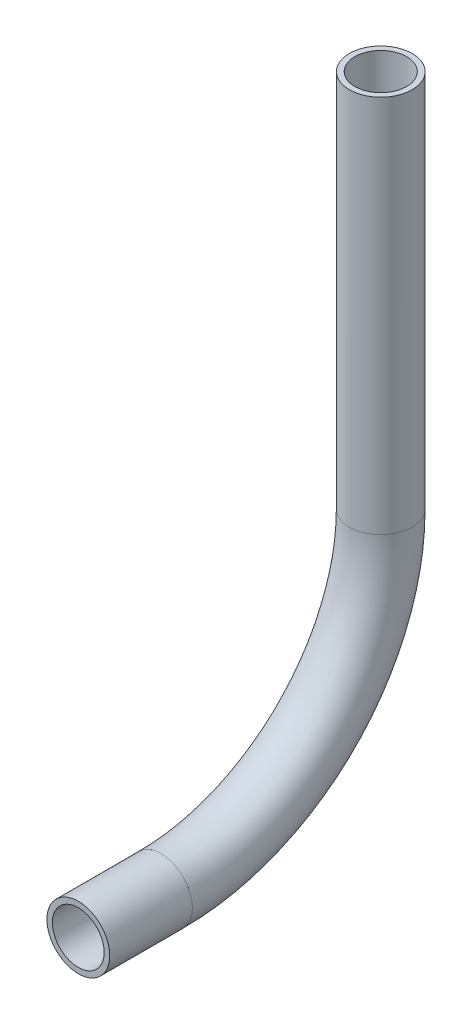
ISO-10303-21;
HEADER;
FILE_DESCRIPTION(('STEP AP214'),'2;1');
FILE_NAME('part.step','',(''),(''),'','','');
FILE_SCHEMA(('AUTOMOTIVE_DESIGN { 1 0 10303 214 1 1 1 1 }'));
ENDSEC;
DATA;
#1=APPLICATION_CONTEXT('core data for automotive mechanical design processes');
#2=APPLICATION_PROTOCOL_DEFINITION('international standard','automotive_design',2000,#1);
#3=PRODUCT_CONTEXT('',#1,'mechanical');
#4=PRODUCT('Part','Part','',(#3));
#5=PRODUCT_RELATED_PRODUCT_CATEGORY('part','',(#4));
#6=PRODUCT_DEFINITION_FORMATION('','',#4);
#7=PRODUCT_DEFINITION_CONTEXT('part definition',#1,'design');
#8=PRODUCT_DEFINITION('design','',#6,#7);
#9=PRODUCT_DEFINITION_SHAPE('','',#8);
#10=(LENGTH_UNIT() NAMED_UNIT(*) SI_UNIT(.MILLI.,.METRE.));
#11=(NAMED_UNIT(*) PLANE_ANGLE_UNIT() SI_UNIT($,.RADIAN.));
#12=(NAMED_UNIT(*) SI_UNIT($,.STERADIAN.) SOLID_ANGLE_UNIT());
#13=UNCERTAINTY_MEASURE_WITH_UNIT(LENGTH_MEASURE(1.E-05),#10,'distance_accuracy_value','');
#14=(GEOMETRIC_REPRESENTATION_CONTEXT(3) GLOBAL_UNCERTAINTY_ASSIGNED_CONTEXT((#13)) GLOBAL_UNIT_ASSIGNED_CONTEXT((#10,
#11,#12)) REPRESENTATION_CONTEXT('',''));
#15=CARTESIAN_POINT('',(0.,0.,0.));
#16=DIRECTION('',(0.,0.,1.));
#17=DIRECTION('',(1.,0.,0.));
#18=AXIS2_PLACEMENT_3D('',#15,#16,#17);
#19=CARTESIAN_POINT('',(0.,600.03453506682,294.786169017656));
#20=DIRECTION('',(0.,0.,1.));
#21=DIRECTION('',(1.,0.,0.));
#22=AXIS2_PLACEMENT_3D('',#19,#20,#21);
#23=CYLINDRICAL_SURFACE('',#22,2.61620000000002);
#24=CARTESIAN_POINT('',(0.,600.03453506682,303.14462575866));
#25=DIRECTION('',(0.,0.,-1.));
#26=DIRECTION('',(-1.,0.,0.));
#27=AXIS2_PLACEMENT_3D('',#24,#25,#26);
#28=CIRCLE('',#27,2.61620000000002);
#29=CARTESIAN_POINT('',(-2.61620000000002,600.03453506682,303.14462575866));
#30=VERTEX_POINT('',#29);
#31=EDGE_CURVE('E55',#30,#30,#28,.T.);
#32=ORIENTED_EDGE('',*,*,#31,.F.);
#33=EDGE_LOOP('',(#32));
#34=FACE_BOUND('',#33,.T.);
#35=CARTESIAN_POINT('',(0.,600.03453506682,294.786169017656));
#36=DIRECTION('',(0.,0.,-1.));
#37=DIRECTION('',(-1.,0.,0.));
#38=AXIS2_PLACEMENT_3D('',#35,#36,#37);
#39=CIRCLE('',#38,2.61620000000002);
#40=CARTESIAN_POINT('',(-2.61620000000002,600.03453506682,294.786169017656));
#41=VERTEX_POINT('',#40);
#42=EDGE_CURVE('E51',#41,#41,#39,.T.);
#43=ORIENTED_EDGE('',*,*,#42,.T.);
#44=EDGE_LOOP('',(#43));
#45=FACE_BOUND('',#44,.T.);
#46=ADVANCED_FACE('F47',(#34,#45),#23,.F.);
#47=CARTESIAN_POINT('',(0.,600.03453506682,294.786169017656));
#48=DIRECTION('',(0.,0.,1.));
#49=DIRECTION('',(1.,0.,0.));
#50=AXIS2_PLACEMENT_3D('',#47,#48,#49);
#51=CYLINDRICAL_SURFACE('',#50,3.17499999999997);
#52=CARTESIAN_POINT('',(0.,600.03453506682,303.14462575866));
#53=DIRECTION('',(0.,0.,-1.));
#54=DIRECTION('',(-1.,0.,0.));
#55=AXIS2_PLACEMENT_3D('',#52,#53,#54);
#56=CIRCLE('',#55,3.17499999999997);
#57=CARTESIAN_POINT('',(-3.17499999999997,600.03453506682,303.14462575866));
#58=VERTEX_POINT('',#57);
#59=EDGE_CURVE('E59',#58,#58,#56,.T.);
#60=ORIENTED_EDGE('',*,*,#59,.T.);
#61=EDGE_LOOP('',(#60));
#62=FACE_BOUND('',#61,.T.);
#63=CARTESIAN_POINT('',(0.,600.03453506682,294.786169017656));
#64=DIRECTION('',(0.,0.,-1.));
#65=DIRECTION('',(-1.,0.,0.));
#66=AXIS2_PLACEMENT_3D('',#63,#64,#65);
#67=CIRCLE('',#66,3.17499999999997);
#68=CARTESIAN_POINT('',(-3.17499999999997,600.03453506682,294.786169017656));
#69=VERTEX_POINT('',#68);
#70=EDGE_CURVE('E12',#69,#69,#67,.T.);
#71=ORIENTED_EDGE('',*,*,#70,.F.);
#72=EDGE_LOOP('',(#71));
#73=FACE_BOUND('',#72,.T.);
#74=ADVANCED_FACE('F74',(#62,#73),#51,.T.);
#75=CARTESIAN_POINT('',(0.,600.03453506682,303.14462575866));
#76=DIRECTION('',(0.,0.,-1.));
#77=DIRECTION('',(-1.,0.,0.));
#78=AXIS2_PLACEMENT_3D('',#75,#76,#77);
#79=PLANE('',#78);
#80=ORIENTED_EDGE('',*,*,#31,.T.);
#81=EDGE_LOOP('',(#80));
#82=FACE_BOUND('',#81,.T.);
#83=ORIENTED_EDGE('',*,*,#59,.F.);
#84=EDGE_LOOP('',(#83));
#85=FACE_BOUND('',#84,.T.);
#86=ADVANCED_FACE('F70',(#82,#85),#79,.F.);
#87=CARTESIAN_POINT('',(0.,600.03453506682,294.786169017656));
#88=DIRECTION('',(0.,0.,-1.));
#89=DIRECTION('',(-1.,0.,0.));
#90=AXIS2_PLACEMENT_3D('',#87,#88,#89);
#91=PLANE('',#90);
#92=ORIENTED_EDGE('',*,*,#42,.F.);
#93=EDGE_LOOP('',(#92));
#94=FACE_BOUND('',#93,.T.);
#95=ORIENTED_EDGE('',*,*,#70,.T.);
#96=EDGE_LOOP('',(#95));
#97=FACE_BOUND('',#96,.T.);
#98=ADVANCED_FACE('F49',(#94,#97),#91,.T.);
#99=CLOSED_SHELL('',(#46,#74,#86,#98));
#100=MANIFOLD_SOLID_BREP('B2',#99);
#101=CARTESIAN_POINT('',(0.,622.25953506682,294.786169017656));
#102=DIRECTION('',(-1.,0.,0.));
#103=DIRECTION('',(0.,0.,1.));
#104=AXIS2_PLACEMENT_3D('',#101,#102,#103);
#105=TOROIDAL_SURFACE('',#104,22.2250000000001,2.61620000000002);
#106=CARTESIAN_POINT('',(0.,622.25953506682,272.561169017656));
#107=DIRECTION('',(0.,1.,0.));
#108=DIRECTION('',(0.,0.,1.));
#109=AXIS2_PLACEMENT_3D('',#106,#107,#108);
#110=CIRCLE('',#109,2.61620000000002);
#111=CARTESIAN_POINT('',(0.,622.25953506682,269.944969017656));
#112=VERTEX_POINT('',#111);
#113=EDGE_CURVE('E150',#112,#112,#110,.T.);
#114=CARTESIAN_POINT('',(0.,600.03453506682,294.786169017656));
#115=DIRECTION('',(0.,0.,1.));
#116=DIRECTION('',(1.,0.,0.));
#117=AXIS2_PLACEMENT_3D('',#114,#115,#116);
#118=CIRCLE('',#117,2.61620000000002);
#119=CARTESIAN_POINT('',(0.,597.41833506682,294.786169017656));
#120=VERTEX_POINT('',#119);
#121=EDGE_CURVE('E140',#120,#120,#118,.T.);
#122=CARTESIAN_POINT('',(0.,622.25953506682,294.786169017656));
#123=DIRECTION('',(-1.,0.,0.));
#124=DIRECTION('',(0.,0.,1.));
#125=AXIS2_PLACEMENT_3D('',#122,#123,#124);
#126=CIRCLE('',#125,24.8412000000001);
#127=EDGE_CURVE('',#112,#120,#126,.T.);
#128=ORIENTED_EDGE('',*,*,#113,.T.);
#129=ORIENTED_EDGE('',*,*,#121,.T.);
#130=ORIENTED_EDGE('',*,*,#127,.T.);
#131=ORIENTED_EDGE('',*,*,#127,.F.);
#132=EDGE_LOOP('',(#128,#130,#129,#131));
#133=FACE_BOUND('',#132,.T.);
#134=ADVANCED_FACE('F136',(#133),#105,.F.);
#135=CARTESIAN_POINT('',(0.,622.25953506682,294.786169017656));
#136=DIRECTION('',(-1.,0.,0.));
#137=DIRECTION('',(0.,0.,1.));
#138=AXIS2_PLACEMENT_3D('',#135,#136,#137);
#139=TOROIDAL_SURFACE('',#138,22.2250000000001,3.17499999999997);
#140=CARTESIAN_POINT('',(0.,622.25953506682,272.561169017656));
#141=DIRECTION('',(0.,1.,0.));
#142=DIRECTION('',(0.,0.,1.));
#143=AXIS2_PLACEMENT_3D('',#140,#141,#142);
#144=CIRCLE('',#143,3.17499999999997);
#145=CARTESIAN_POINT('',(0.,622.25953506682,269.386169017656));
#146=VERTEX_POINT('',#145);
#147=EDGE_CURVE('E144',#146,#146,#144,.T.);
#148=CARTESIAN_POINT('',(0.,600.03453506682,294.786169017656));
#149=DIRECTION('',(0.,0.,1.));
#150=DIRECTION('',(1.,0.,0.));
#151=AXIS2_PLACEMENT_3D('',#148,#149,#150);
#152=CIRCLE('',#151,3.17499999999997);
#153=CARTESIAN_POINT('',(0.,596.85953506682,294.786169017656));
#154=VERTEX_POINT('',#153);
#155=EDGE_CURVE('E46',#154,#154,#152,.T.);
#156=CARTESIAN_POINT('',(0.,622.25953506682,294.786169017656));
#157=DIRECTION('',(-1.,0.,0.));
#158=DIRECTION('',(0.,0.,1.));
#159=AXIS2_PLACEMENT_3D('',#156,#157,#158);
#160=CIRCLE('',#159,25.4000000000001);
#161=EDGE_CURVE('',#146,#154,#160,.T.);
#162=ORIENTED_EDGE('',*,*,#147,.F.);
#163=ORIENTED_EDGE('',*,*,#155,.F.);
#164=ORIENTED_EDGE('',*,*,#161,.T.);
#165=ORIENTED_EDGE('',*,*,#161,.F.);
#166=EDGE_LOOP('',(#162,#164,#163,#165));
#167=FACE_BOUND('',#166,.T.);
#168=ADVANCED_FACE('F163',(#167),#139,.T.);
#169=CARTESIAN_POINT('',(0.,622.25953506682,272.561169017656));
#170=DIRECTION('',(0.,1.,0.));
#171=DIRECTION('',(0.,0.,1.));
#172=AXIS2_PLACEMENT_3D('',#169,#170,#171);
#173=PLANE('',#172);
#174=ORIENTED_EDGE('',*,*,#113,.F.);
#175=EDGE_LOOP('',(#174));
#176=FACE_BOUND('',#175,.T.);
#177=ORIENTED_EDGE('',*,*,#147,.T.);
#178=EDGE_LOOP('',(#177));
#179=FACE_BOUND('',#178,.T.);
#180=ADVANCED_FACE('F159',(#176,#179),#173,.T.);
#181=CARTESIAN_POINT('',(0.,600.03453506682,294.786169017656));
#182=DIRECTION('',(0.,0.,1.));
#183=DIRECTION('',(1.,0.,0.));
#184=AXIS2_PLACEMENT_3D('',#181,#182,#183);
#185=PLANE('',#184);
#186=ORIENTED_EDGE('',*,*,#121,.F.);
#187=EDGE_LOOP('',(#186));
#188=FACE_BOUND('',#187,.T.);
#189=ORIENTED_EDGE('',*,*,#155,.T.);
#190=EDGE_LOOP('',(#189));
#191=FACE_BOUND('',#190,.T.);
#192=ADVANCED_FACE('F138',(#188,#191),#185,.T.);
#193=CLOSED_SHELL('',(#134,#168,#180,#192));
#194=MANIFOLD_SOLID_BREP('B7',#193);
#195=CARTESIAN_POINT('',(0.,660.572281208422,272.561169017656));
#196=DIRECTION('',(0.,-1.,0.));
#197=DIRECTION('',(0.,0.,-1.));
#198=AXIS2_PLACEMENT_3D('',#195,#196,#197);
#199=CYLINDRICAL_SURFACE('',#198,2.61620000000002);
#200=CARTESIAN_POINT('',(0.,660.572281208422,272.561169017656));
#201=DIRECTION('',(0.,1.,0.));
#202=DIRECTION('',(-1.,0.,0.));
#203=AXIS2_PLACEMENT_3D('',#200,#201,#202);
#204=CIRCLE('',#203,2.61620000000002);
#205=CARTESIAN_POINT('',(-2.61620000000002,660.572281208422,272.561169017656));
#206=VERTEX_POINT('',#205);
#207=EDGE_CURVE('E234',#206,#206,#204,.T.);
#208=ORIENTED_EDGE('',*,*,#207,.T.);
#209=EDGE_LOOP('',(#208));
#210=FACE_BOUND('',#209,.T.);
#211=CARTESIAN_POINT('',(0.,622.25953506682,272.561169017656));
#212=DIRECTION('',(0.,-1.,0.));
#213=DIRECTION('',(0.,0.,-1.));
#214=AXIS2_PLACEMENT_3D('',#211,#212,#213);
#215=CIRCLE('',#214,2.61620000000002);
#216=CARTESIAN_POINT('',(0.,622.25953506682,269.944969017656));
#217=VERTEX_POINT('',#216);
#218=EDGE_CURVE('E224',#217,#217,#215,.T.);
#219=ORIENTED_EDGE('',*,*,#218,.T.);
#220=EDGE_LOOP('',(#219));
#221=FACE_BOUND('',#220,.T.);
#222=ADVANCED_FACE('F220',(#210,#221),#199,.F.);
#223=CARTESIAN_POINT('',(0.,660.572281208422,272.561169017656));
#224=DIRECTION('',(0.,-1.,0.));
#225=DIRECTION('',(0.,0.,-1.));
#226=AXIS2_PLACEMENT_3D('',#223,#224,#225);
#227=CYLINDRICAL_SURFACE('',#226,3.17499999999997);
#228=CARTESIAN_POINT('',(0.,660.572281208422,272.561169017656));
#229=DIRECTION('',(0.,1.,0.));
#230=DIRECTION('',(-1.,0.,0.));
#231=AXIS2_PLACEMENT_3D('',#228,#229,#230);
#232=CIRCLE('',#231,3.17499999999997);
#233=CARTESIAN_POINT('',(-3.17499999999997,660.572281208422,272.561169017656));
#234=VERTEX_POINT('',#233);
#235=EDGE_CURVE('E228',#234,#234,#232,.T.);
#236=ORIENTED_EDGE('',*,*,#235,.F.);
#237=EDGE_LOOP('',(#236));
#238=FACE_BOUND('',#237,.T.);
#239=CARTESIAN_POINT('',(0.,622.25953506682,272.561169017656));
#240=DIRECTION('',(0.,-1.,0.));
#241=DIRECTION('',(0.,0.,-1.));
#242=AXIS2_PLACEMENT_3D('',#239,#240,#241);
#243=CIRCLE('',#242,3.17499999999997);
#244=CARTESIAN_POINT('',(0.,622.25953506682,269.386169017656));
#245=VERTEX_POINT('',#244);
#246=EDGE_CURVE('E135',#245,#245,#243,.T.);
#247=ORIENTED_EDGE('',*,*,#246,.F.);
#248=EDGE_LOOP('',(#247));
#249=FACE_BOUND('',#248,.T.);
#250=ADVANCED_FACE('F247',(#238,#249),#227,.T.);
#251=CARTESIAN_POINT('',(0.,660.572281208422,272.561169017656));
#252=DIRECTION('',(0.,1.,0.));
#253=DIRECTION('',(-1.,0.,0.));
#254=AXIS2_PLACEMENT_3D('',#251,#252,#253);
#255=PLANE('',#254);
#256=ORIENTED_EDGE('',*,*,#207,.F.);
#257=EDGE_LOOP('',(#256));
#258=FACE_BOUND('',#257,.T.);
#259=ORIENTED_EDGE('',*,*,#235,.T.);
#260=EDGE_LOOP('',(#259));
#261=FACE_BOUND('',#260,.T.);
#262=ADVANCED_FACE('F243',(#258,#261),#255,.T.);
#263=CARTESIAN_POINT('',(0.,622.25953506682,272.561169017656));
#264=DIRECTION('',(0.,-1.,0.));
#265=DIRECTION('',(0.,0.,-1.));
#266=AXIS2_PLACEMENT_3D('',#263,#264,#265);
#267=PLANE('',#266);
#268=ORIENTED_EDGE('',*,*,#218,.F.);
#269=EDGE_LOOP('',(#268));
#270=FACE_BOUND('',#269,.T.);
#271=ORIENTED_EDGE('',*,*,#246,.T.);
#272=EDGE_LOOP('',(#271));
#273=FACE_BOUND('',#272,.T.);
#274=ADVANCED_FACE('F222',(#270,#273),#267,.T.);
#275=CLOSED_SHELL('',(#222,#250,#262,#274));
#276=MANIFOLD_SOLID_BREP('B41',#275);
#277=ADVANCED_BREP_SHAPE_REPRESENTATION('',(#18,#100,#194,#276),#14);
#278=SHAPE_DEFINITION_REPRESENTATION(#9,#277);
ENDSEC;
END-ISO-10303-21;
